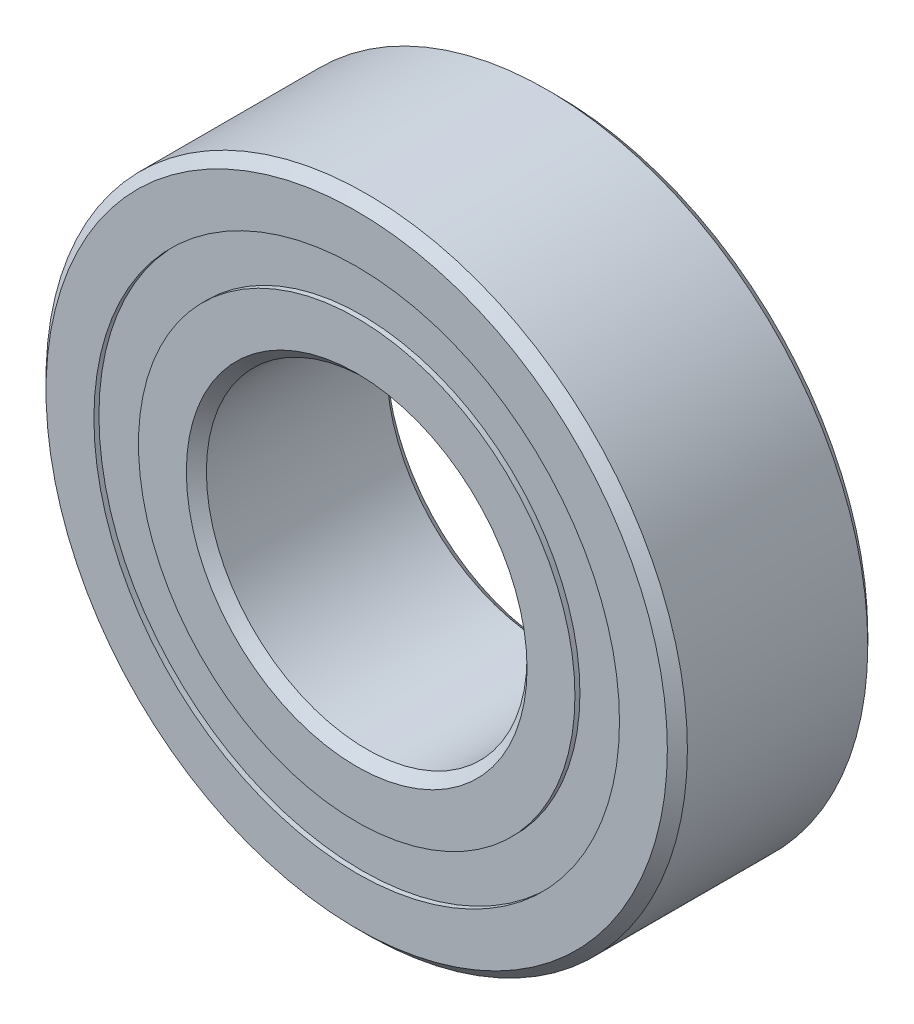
ISO-10303-21;
HEADER;
FILE_DESCRIPTION(('STEP AP214'),'2;1');
FILE_NAME('part.step','',(''),(''),'','','');
FILE_SCHEMA(('AUTOMOTIVE_DESIGN { 1 0 10303 214 1 1 1 1 }'));
ENDSEC;
DATA;
#1=APPLICATION_CONTEXT('core data for automotive mechanical design processes');
#2=APPLICATION_PROTOCOL_DEFINITION('international standard','automotive_design',2000,#1);
#3=PRODUCT_CONTEXT('',#1,'mechanical');
#4=PRODUCT('Part','Part','',(#3));
#5=PRODUCT_RELATED_PRODUCT_CATEGORY('part','',(#4));
#6=PRODUCT_DEFINITION_FORMATION('','',#4);
#7=PRODUCT_DEFINITION_CONTEXT('part definition',#1,'design');
#8=PRODUCT_DEFINITION('design','',#6,#7);
#9=PRODUCT_DEFINITION_SHAPE('','',#8);
#10=(LENGTH_UNIT() NAMED_UNIT(*) SI_UNIT(.MILLI.,.METRE.));
#11=(NAMED_UNIT(*) PLANE_ANGLE_UNIT() SI_UNIT($,.RADIAN.));
#12=(NAMED_UNIT(*) SI_UNIT($,.STERADIAN.) SOLID_ANGLE_UNIT());
#13=UNCERTAINTY_MEASURE_WITH_UNIT(LENGTH_MEASURE(1.E-05),#10,'distance_accuracy_value','');
#14=(GEOMETRIC_REPRESENTATION_CONTEXT(3) GLOBAL_UNCERTAINTY_ASSIGNED_CONTEXT((#13)) GLOBAL_UNIT_ASSIGNED_CONTEXT((#10,
#11,#12)) REPRESENTATION_CONTEXT('',''));
#15=CARTESIAN_POINT('',(0.,0.,0.));
#16=DIRECTION('',(0.,0.,1.));
#17=DIRECTION('',(1.,0.,0.));
#18=AXIS2_PLACEMENT_3D('',#15,#16,#17);
#19=CARTESIAN_POINT('',(0.,6.55555555555555,-1.24225998749989));
#20=DIRECTION('',(0.,0.,-1.));
#21=DIRECTION('',(-1.,0.,0.));
#22=AXIS2_PLACEMENT_3D('',#19,#20,#21);
#23=PLANE('',#22);
#24=CARTESIAN_POINT('',(0.,0.,-1.24225998749989));
#25=DIRECTION('',(0.,0.,1.));
#26=DIRECTION('',(1.,0.,0.));
#27=AXIS2_PLACEMENT_3D('',#24,#25,#26);
#28=CIRCLE('',#27,5.44444444444445);
#29=CARTESIAN_POINT('',(5.44444444444445,0.,-1.24225998749989));
#30=VERTEX_POINT('',#29);
#31=EDGE_CURVE('E11',#30,#30,#28,.T.);
#32=ORIENTED_EDGE('',*,*,#31,.F.);
#33=EDGE_LOOP('',(#32));
#34=FACE_BOUND('',#33,.T.);
#35=CARTESIAN_POINT('',(0.,0.,-1.24225998749988));
#36=DIRECTION('',(0.,0.,1.));
#37=DIRECTION('',(1.,0.,0.));
#38=AXIS2_PLACEMENT_3D('',#35,#36,#37);
#39=CIRCLE('',#38,6.55555555555555);
#40=CARTESIAN_POINT('',(6.55555555555555,0.,-1.24225998749988));
#41=VERTEX_POINT('',#40);
#42=EDGE_CURVE('E60',#41,#41,#39,.T.);
#43=ORIENTED_EDGE('',*,*,#42,.T.);
#44=EDGE_LOOP('',(#43));
#45=FACE_BOUND('',#44,.T.);
#46=ADVANCED_FACE('F46',(#34,#45),#23,.F.);
#47=CARTESIAN_POINT('',(0.,0.,2.5));
#48=DIRECTION('',(0.,0.,1.));
#49=DIRECTION('',(1.,0.,0.));
#50=AXIS2_PLACEMENT_3D('',#47,#48,#49);
#51=CYLINDRICAL_SURFACE('',#50,5.44444444444445);
#52=CARTESIAN_POINT('',(0.,0.,-2.375));
#53=DIRECTION('',(0.,0.,1.));
#54=DIRECTION('',(1.,0.,0.));
#55=AXIS2_PLACEMENT_3D('',#52,#53,#54);
#56=CIRCLE('',#55,5.44444444444445);
#57=CARTESIAN_POINT('',(5.44444444444445,0.,-2.375));
#58=VERTEX_POINT('',#57);
#59=EDGE_CURVE('E52',#58,#58,#56,.T.);
#60=ORIENTED_EDGE('',*,*,#59,.F.);
#61=EDGE_LOOP('',(#60));
#62=FACE_BOUND('',#61,.T.);
#63=ORIENTED_EDGE('',*,*,#31,.T.);
#64=EDGE_LOOP('',(#63));
#65=FACE_BOUND('',#64,.T.);
#66=ADVANCED_FACE('F75',(#62,#65),#51,.F.);
#67=CARTESIAN_POINT('',(0.,6.55555555555555,-2.375));
#68=DIRECTION('',(0.,0.,1.));
#69=DIRECTION('',(1.,0.,0.));
#70=AXIS2_PLACEMENT_3D('',#67,#68,#69);
#71=PLANE('',#70);
#72=CARTESIAN_POINT('',(0.,0.,-2.375));
#73=DIRECTION('',(0.,0.,1.));
#74=DIRECTION('',(1.,0.,0.));
#75=AXIS2_PLACEMENT_3D('',#72,#73,#74);
#76=CIRCLE('',#75,6.55555555555555);
#77=CARTESIAN_POINT('',(6.55555555555555,0.,-2.375));
#78=VERTEX_POINT('',#77);
#79=EDGE_CURVE('E56',#78,#78,#76,.T.);
#80=ORIENTED_EDGE('',*,*,#79,.F.);
#81=EDGE_LOOP('',(#80));
#82=FACE_BOUND('',#81,.T.);
#83=ORIENTED_EDGE('',*,*,#59,.T.);
#84=EDGE_LOOP('',(#83));
#85=FACE_BOUND('',#84,.T.);
#86=ADVANCED_FACE('F70',(#82,#85),#71,.F.);
#87=CARTESIAN_POINT('',(0.,0.,2.5));
#88=DIRECTION('',(0.,0.,1.));
#89=DIRECTION('',(1.,0.,0.));
#90=AXIS2_PLACEMENT_3D('',#87,#88,#89);
#91=CYLINDRICAL_SURFACE('',#90,6.55555555555555);
#92=ORIENTED_EDGE('',*,*,#42,.F.);
#93=EDGE_LOOP('',(#92));
#94=FACE_BOUND('',#93,.T.);
#95=ORIENTED_EDGE('',*,*,#79,.T.);
#96=EDGE_LOOP('',(#95));
#97=FACE_BOUND('',#96,.T.);
#98=ADVANCED_FACE('F67',(#94,#97),#91,.T.);
#99=CLOSED_SHELL('',(#46,#66,#86,#98));
#100=MANIFOLD_SOLID_BREP('B2',#99);
#101=CARTESIAN_POINT('',(0.,6.55555555555555,2.375));
#102=DIRECTION('',(0.,0.,-1.));
#103=DIRECTION('',(-1.,0.,0.));
#104=AXIS2_PLACEMENT_3D('',#101,#102,#103);
#105=PLANE('',#104);
#106=CARTESIAN_POINT('',(0.,0.,2.375));
#107=DIRECTION('',(0.,0.,1.));
#108=DIRECTION('',(1.,0.,0.));
#109=AXIS2_PLACEMENT_3D('',#106,#107,#108);
#110=CIRCLE('',#109,5.44444444444445);
#111=CARTESIAN_POINT('',(5.44444444444445,0.,2.375));
#112=VERTEX_POINT('',#111);
#113=EDGE_CURVE('E45',#112,#112,#110,.T.);
#114=ORIENTED_EDGE('',*,*,#113,.F.);
#115=EDGE_LOOP('',(#114));
#116=FACE_BOUND('',#115,.T.);
#117=CARTESIAN_POINT('',(0.,0.,2.375));
#118=DIRECTION('',(0.,0.,1.));
#119=DIRECTION('',(1.,0.,0.));
#120=AXIS2_PLACEMENT_3D('',#117,#118,#119);
#121=CIRCLE('',#120,6.55555555555555);
#122=CARTESIAN_POINT('',(6.55555555555555,0.,2.375));
#123=VERTEX_POINT('',#122);
#124=EDGE_CURVE('E128',#123,#123,#121,.T.);
#125=ORIENTED_EDGE('',*,*,#124,.T.);
#126=EDGE_LOOP('',(#125));
#127=FACE_BOUND('',#126,.T.);
#128=ADVANCED_FACE('F114',(#116,#127),#105,.F.);
#129=CARTESIAN_POINT('',(0.,0.,2.5));
#130=DIRECTION('',(0.,0.,1.));
#131=DIRECTION('',(1.,0.,0.));
#132=AXIS2_PLACEMENT_3D('',#129,#130,#131);
#133=CYLINDRICAL_SURFACE('',#132,5.44444444444445);
#134=CARTESIAN_POINT('',(0.,0.,1.24225998749988));
#135=DIRECTION('',(0.,0.,1.));
#136=DIRECTION('',(1.,0.,0.));
#137=AXIS2_PLACEMENT_3D('',#134,#135,#136);
#138=CIRCLE('',#137,5.44444444444445);
#139=CARTESIAN_POINT('',(5.44444444444445,0.,1.24225998749988));
#140=VERTEX_POINT('',#139);
#141=EDGE_CURVE('E120',#140,#140,#138,.T.);
#142=ORIENTED_EDGE('',*,*,#141,.F.);
#143=EDGE_LOOP('',(#142));
#144=FACE_BOUND('',#143,.T.);
#145=ORIENTED_EDGE('',*,*,#113,.T.);
#146=EDGE_LOOP('',(#145));
#147=FACE_BOUND('',#146,.T.);
#148=ADVANCED_FACE('F143',(#144,#147),#133,.F.);
#149=CARTESIAN_POINT('',(0.,6.55555555555555,1.24225998749988));
#150=DIRECTION('',(0.,0.,1.));
#151=DIRECTION('',(1.,0.,0.));
#152=AXIS2_PLACEMENT_3D('',#149,#150,#151);
#153=PLANE('',#152);
#154=CARTESIAN_POINT('',(0.,0.,1.24225998749988));
#155=DIRECTION('',(0.,0.,1.));
#156=DIRECTION('',(1.,0.,0.));
#157=AXIS2_PLACEMENT_3D('',#154,#155,#156);
#158=CIRCLE('',#157,6.55555555555555);
#159=CARTESIAN_POINT('',(6.55555555555555,0.,1.24225998749988));
#160=VERTEX_POINT('',#159);
#161=EDGE_CURVE('E124',#160,#160,#158,.T.);
#162=ORIENTED_EDGE('',*,*,#161,.F.);
#163=EDGE_LOOP('',(#162));
#164=FACE_BOUND('',#163,.T.);
#165=ORIENTED_EDGE('',*,*,#141,.T.);
#166=EDGE_LOOP('',(#165));
#167=FACE_BOUND('',#166,.T.);
#168=ADVANCED_FACE('F138',(#164,#167),#153,.F.);
#169=CARTESIAN_POINT('',(0.,0.,2.5));
#170=DIRECTION('',(0.,0.,1.));
#171=DIRECTION('',(1.,0.,0.));
#172=AXIS2_PLACEMENT_3D('',#169,#170,#171);
#173=CYLINDRICAL_SURFACE('',#172,6.55555555555555);
#174=ORIENTED_EDGE('',*,*,#124,.F.);
#175=EDGE_LOOP('',(#174));
#176=FACE_BOUND('',#175,.T.);
#177=ORIENTED_EDGE('',*,*,#161,.T.);
#178=EDGE_LOOP('',(#177));
#179=FACE_BOUND('',#178,.T.);
#180=ADVANCED_FACE('F135',(#176,#179),#173,.T.);
#181=CLOSED_SHELL('',(#128,#148,#168,#180));
#182=MANIFOLD_SOLID_BREP('B6',#181);
#183=CARTESIAN_POINT('',(-2.60330243470528,5.40581320741455,0.));
#184=DIRECTION('',(0.,0.,1.));
#185=DIRECTION('',(-0.433883739117546,0.900968867902425,0.));
#186=AXIS2_PLACEMENT_3D('',#183,#184,#185);
#187=SPHERICAL_SURFACE('',#186,1.24225998749988);
#188=CARTESIAN_POINT('',(-2.60330243470528,5.40581320741455,1.24225998749987));
#189=VERTEX_POINT('',#188);
#190=VERTEX_LOOP('',#189);
#191=FACE_BOUND('',#190,.T.);
#192=ADVANCED_FACE('F182',(#191),#187,.T.);
#193=CLOSED_SHELL('',(#192));
#194=MANIFOLD_SOLID_BREP('B40',#193);
#195=CARTESIAN_POINT('',(-4.69098889480813,3.74093881115246,0.));
#196=DIRECTION('',(0.,0.,1.));
#197=DIRECTION('',(-0.781831482468022,0.623489801858743,0.));
#198=AXIS2_PLACEMENT_3D('',#195,#196,#197);
#199=SPHERICAL_SURFACE('',#198,1.24225998749988);
#200=CARTESIAN_POINT('',(-4.69098889480813,3.74093881115246,1.24225998749987));
#201=VERTEX_POINT('',#200);
#202=VERTEX_LOOP('',#201);
#203=FACE_BOUND('',#202,.T.);
#204=ADVANCED_FACE('F216',(#203),#199,.T.);
#205=CLOSED_SHELL('',(#204));
#206=MANIFOLD_SOLID_BREP('B110',#205);
#207=CARTESIAN_POINT('',(-5.84956747309093,1.33512560373795,0.));
#208=DIRECTION('',(0.,0.,1.));
#209=DIRECTION('',(-0.974927912181821,0.222520933956325,0.));
#210=AXIS2_PLACEMENT_3D('',#207,#208,#209);
#211=SPHERICAL_SURFACE('',#210,1.24225998749988);
#212=CARTESIAN_POINT('',(-5.84956747309093,1.33512560373795,1.24225998749987));
#213=VERTEX_POINT('',#212);
#214=VERTEX_LOOP('',#213);
#215=FACE_BOUND('',#214,.T.);
#216=ADVANCED_FACE('F250',(#215),#211,.T.);
#217=CLOSED_SHELL('',(#216));
#218=MANIFOLD_SOLID_BREP('B178',#217);
#219=CARTESIAN_POINT('',(-5.84956747309096,-1.33512560373783,0.));
#220=DIRECTION('',(0.,0.,1.));
#221=DIRECTION('',(-0.974927912181826,-0.222520933956305,0.));
#222=AXIS2_PLACEMENT_3D('',#219,#220,#221);
#223=SPHERICAL_SURFACE('',#222,1.24225998749988);
#224=CARTESIAN_POINT('',(-5.84956747309096,-1.33512560373783,1.24225998749987));
#225=VERTEX_POINT('',#224);
#226=VERTEX_LOOP('',#225);
#227=FACE_BOUND('',#226,.T.);
#228=ADVANCED_FACE('F284',(#227),#223,.T.);
#229=CLOSED_SHELL('',(#228));
#230=MANIFOLD_SOLID_BREP('B212',#229);
#231=CARTESIAN_POINT('',(-4.69098889480821,-3.74093881115236,0.));
#232=DIRECTION('',(0.,0.,1.));
#233=DIRECTION('',(-0.781831482468035,-0.623489801858727,0.));
#234=AXIS2_PLACEMENT_3D('',#231,#232,#233);
#235=SPHERICAL_SURFACE('',#234,1.24225998749988);
#236=CARTESIAN_POINT('',(-4.69098889480821,-3.74093881115236,1.24225998749987));
#237=VERTEX_POINT('',#236);
#238=VERTEX_LOOP('',#237);
#239=FACE_BOUND('',#238,.T.);
#240=ADVANCED_FACE('F318',(#239),#235,.T.);
#241=CLOSED_SHELL('',(#240));
#242=MANIFOLD_SOLID_BREP('B246',#241);
#243=CARTESIAN_POINT('',(-2.60330243470539,-5.4058132074145,0.));
#244=DIRECTION('',(0.,0.,1.));
#245=DIRECTION('',(-0.433883739117565,-0.900968867902416,0.));
#246=AXIS2_PLACEMENT_3D('',#243,#244,#245);
#247=SPHERICAL_SURFACE('',#246,1.24225998749988);
#248=CARTESIAN_POINT('',(-2.60330243470539,-5.4058132074145,1.24225998749987));
#249=VERTEX_POINT('',#248);
#250=VERTEX_LOOP('',#249);
#251=FACE_BOUND('',#250,.T.);
#252=ADVANCED_FACE('F352',(#251),#247,.T.);
#253=CLOSED_SHELL('',(#252));
#254=MANIFOLD_SOLID_BREP('B280',#253);
#255=CARTESIAN_POINT('',(0.,-6.,0.));
#256=DIRECTION('',(0.,0.,1.));
#257=DIRECTION('',(0.,-1.,0.));
#258=AXIS2_PLACEMENT_3D('',#255,#256,#257);
#259=SPHERICAL_SURFACE('',#258,1.24225998749988);
#260=CARTESIAN_POINT('',(0.,-6.,1.24225998749987));
#261=VERTEX_POINT('',#260);
#262=VERTEX_LOOP('',#261);
#263=FACE_BOUND('',#262,.T.);
#264=ADVANCED_FACE('F386',(#263),#259,.T.);
#265=CLOSED_SHELL('',(#264));
#266=MANIFOLD_SOLID_BREP('B314',#265);
#267=CARTESIAN_POINT('',(2.60330243470532,-5.40581320741453,0.));
#268=DIRECTION('',(0.,0.,1.));
#269=DIRECTION('',(0.433883739117553,-0.900968867902422,0.));
#270=AXIS2_PLACEMENT_3D('',#267,#268,#269);
#271=SPHERICAL_SURFACE('',#270,1.24225998749988);
#272=CARTESIAN_POINT('',(2.60330243470532,-5.40581320741453,1.24225998749987));
#273=VERTEX_POINT('',#272);
#274=VERTEX_LOOP('',#273);
#275=FACE_BOUND('',#274,.T.);
#276=ADVANCED_FACE('F420',(#275),#271,.T.);
#277=CLOSED_SHELL('',(#276));
#278=MANIFOLD_SOLID_BREP('B348',#277);
#279=CARTESIAN_POINT('',(4.69098889480816,-3.74093881115242,0.));
#280=DIRECTION('',(0.,0.,1.));
#281=DIRECTION('',(0.781831482468027,-0.623489801858737,0.));
#282=AXIS2_PLACEMENT_3D('',#279,#280,#281);
#283=SPHERICAL_SURFACE('',#282,1.24225998749988);
#284=CARTESIAN_POINT('',(4.69098889480816,-3.74093881115242,1.24225998749987));
#285=VERTEX_POINT('',#284);
#286=VERTEX_LOOP('',#285);
#287=FACE_BOUND('',#286,.T.);
#288=ADVANCED_FACE('F454',(#287),#283,.T.);
#289=CLOSED_SHELL('',(#288));
#290=MANIFOLD_SOLID_BREP('B382',#289);
#291=CARTESIAN_POINT('',(5.84956747309094,-1.33512560373791,0.));
#292=DIRECTION('',(0.,0.,1.));
#293=DIRECTION('',(0.974927912181823,-0.222520933956318,0.));
#294=AXIS2_PLACEMENT_3D('',#291,#292,#293);
#295=SPHERICAL_SURFACE('',#294,1.24225998749988);
#296=CARTESIAN_POINT('',(5.84956747309094,-1.33512560373791,1.24225998749987));
#297=VERTEX_POINT('',#296);
#298=VERTEX_LOOP('',#297);
#299=FACE_BOUND('',#298,.T.);
#300=ADVANCED_FACE('F488',(#299),#295,.T.);
#301=CLOSED_SHELL('',(#300));
#302=MANIFOLD_SOLID_BREP('B416',#301);
#303=CARTESIAN_POINT('',(5.84956747309095,1.33512560373787,0.));
#304=DIRECTION('',(0.,0.,1.));
#305=DIRECTION('',(0.974927912181824,0.222520933956311,0.));
#306=AXIS2_PLACEMENT_3D('',#303,#304,#305);
#307=SPHERICAL_SURFACE('',#306,1.24225998749988);
#308=CARTESIAN_POINT('',(5.84956747309095,1.33512560373787,1.24225998749987));
#309=VERTEX_POINT('',#308);
#310=VERTEX_LOOP('',#309);
#311=FACE_BOUND('',#310,.T.);
#312=ADVANCED_FACE('F522',(#311),#307,.T.);
#313=CLOSED_SHELL('',(#312));
#314=MANIFOLD_SOLID_BREP('B450',#313);
#315=CARTESIAN_POINT('',(4.69098889480819,3.74093881115239,0.));
#316=DIRECTION('',(0.,0.,1.));
#317=DIRECTION('',(0.781831482468031,0.623489801858732,0.));
#318=AXIS2_PLACEMENT_3D('',#315,#316,#317);
#319=SPHERICAL_SURFACE('',#318,1.24225998749988);
#320=CARTESIAN_POINT('',(4.69098889480819,3.74093881115239,1.24225998749987));
#321=VERTEX_POINT('',#320);
#322=VERTEX_LOOP('',#321);
#323=FACE_BOUND('',#322,.T.);
#324=ADVANCED_FACE('F556',(#323),#319,.T.);
#325=CLOSED_SHELL('',(#324));
#326=MANIFOLD_SOLID_BREP('B484',#325);
#327=CARTESIAN_POINT('',(2.60330243470535,5.40581320741451,0.));
#328=DIRECTION('',(0.,0.,1.));
#329=DIRECTION('',(0.433883739117559,0.900968867902419,0.));
#330=AXIS2_PLACEMENT_3D('',#327,#328,#329);
#331=SPHERICAL_SURFACE('',#330,1.24225998749988);
#332=CARTESIAN_POINT('',(2.60330243470535,5.40581320741451,1.24225998749987));
#333=VERTEX_POINT('',#332);
#334=VERTEX_LOOP('',#333);
#335=FACE_BOUND('',#334,.T.);
#336=ADVANCED_FACE('F590',(#335),#331,.T.);
#337=CLOSED_SHELL('',(#336));
#338=MANIFOLD_SOLID_BREP('B518',#337);
#339=CARTESIAN_POINT('',(0.,6.,0.));
#340=DIRECTION('',(0.,0.,1.));
#341=DIRECTION('',(0.,1.,0.));
#342=AXIS2_PLACEMENT_3D('',#339,#340,#341);
#343=SPHERICAL_SURFACE('',#342,1.24225998749988);
#344=CARTESIAN_POINT('',(0.,6.,1.24225998749987));
#345=VERTEX_POINT('',#344);
#346=VERTEX_LOOP('',#345);
#347=FACE_BOUND('',#346,.T.);
#348=ADVANCED_FACE('F626',(#347),#343,.T.);
#349=CLOSED_SHELL('',(#348));
#350=MANIFOLD_SOLID_BREP('B552',#349);
#351=CARTESIAN_POINT('',(0.,5.44444444444445,2.5));
#352=DIRECTION('',(0.,0.,-1.));
#353=DIRECTION('',(-1.,0.,0.));
#354=AXIS2_PLACEMENT_3D('',#351,#352,#353);
#355=PLANE('',#354);
#356=CARTESIAN_POINT('',(0.,0.,2.5));
#357=DIRECTION('',(0.,0.,1.));
#358=DIRECTION('',(1.,0.,0.));
#359=AXIS2_PLACEMENT_3D('',#356,#357,#358);
#360=CIRCLE('',#359,4.25);
#361=CARTESIAN_POINT('',(4.25,0.,2.5));
#362=VERTEX_POINT('',#361);
#363=EDGE_CURVE('E625',#362,#362,#360,.T.);
#364=ORIENTED_EDGE('',*,*,#363,.F.);
#365=EDGE_LOOP('',(#364));
#366=FACE_BOUND('',#365,.T.);
#367=CARTESIAN_POINT('',(0.,0.,2.5));
#368=DIRECTION('',(0.,0.,1.));
#369=DIRECTION('',(1.,0.,0.));
#370=AXIS2_PLACEMENT_3D('',#367,#368,#369);
#371=CIRCLE('',#370,5.44444444444445);
#372=CARTESIAN_POINT('',(5.44444444444445,0.,2.5));
#373=VERTEX_POINT('',#372);
#374=EDGE_CURVE('E674',#373,#373,#371,.T.);
#375=ORIENTED_EDGE('',*,*,#374,.T.);
#376=EDGE_LOOP('',(#375));
#377=FACE_BOUND('',#376,.T.);
#378=ADVANCED_FACE('F646',(#366,#377),#355,.F.);
#379=CARTESIAN_POINT('',(0.,0.,2.5));
#380=DIRECTION('',(0.,0.,1.));
#381=DIRECTION('',(1.,0.,0.));
#382=AXIS2_PLACEMENT_3D('',#379,#380,#381);
#383=CONICAL_SURFACE('',#382,4.25,0.785398163397445);
#384=CARTESIAN_POINT('',(0.,0.,2.25));
#385=DIRECTION('',(0.,0.,1.));
#386=DIRECTION('',(1.,0.,0.));
#387=AXIS2_PLACEMENT_3D('',#384,#385,#386);
#388=CIRCLE('',#387,4.);
#389=CARTESIAN_POINT('',(4.,0.,2.25));
#390=VERTEX_POINT('',#389);
#391=EDGE_CURVE('E652',#390,#390,#388,.T.);
#392=ORIENTED_EDGE('',*,*,#391,.F.);
#393=EDGE_LOOP('',(#392));
#394=FACE_BOUND('',#393,.T.);
#395=ORIENTED_EDGE('',*,*,#363,.T.);
#396=EDGE_LOOP('',(#395));
#397=FACE_BOUND('',#396,.T.);
#398=ADVANCED_FACE('F711',(#394,#397),#383,.F.);
#399=CARTESIAN_POINT('',(0.,0.,2.5));
#400=DIRECTION('',(0.,0.,1.));
#401=DIRECTION('',(1.,0.,0.));
#402=AXIS2_PLACEMENT_3D('',#399,#400,#401);
#403=CYLINDRICAL_SURFACE('',#402,4.);
#404=CARTESIAN_POINT('',(0.,0.,-2.25));
#405=DIRECTION('',(0.,0.,1.));
#406=DIRECTION('',(1.,0.,0.));
#407=AXIS2_PLACEMENT_3D('',#404,#405,#406);
#408=CIRCLE('',#407,4.);
#409=CARTESIAN_POINT('',(4.,0.,-2.25));
#410=VERTEX_POINT('',#409);
#411=EDGE_CURVE('E656',#410,#410,#408,.T.);
#412=ORIENTED_EDGE('',*,*,#411,.F.);
#413=EDGE_LOOP('',(#412));
#414=FACE_BOUND('',#413,.T.);
#415=ORIENTED_EDGE('',*,*,#391,.T.);
#416=EDGE_LOOP('',(#415));
#417=FACE_BOUND('',#416,.T.);
#418=ADVANCED_FACE('F706',(#414,#417),#403,.F.);
#419=CARTESIAN_POINT('',(0.,0.,-2.25));
#420=DIRECTION('',(0.,0.,-1.));
#421=DIRECTION('',(-1.,0.,0.));
#422=AXIS2_PLACEMENT_3D('',#419,#420,#421);
#423=CONICAL_SURFACE('',#422,4.,0.785398163397448);
#424=CARTESIAN_POINT('',(0.,0.,-2.5));
#425=DIRECTION('',(0.,0.,1.));
#426=DIRECTION('',(1.,0.,0.));
#427=AXIS2_PLACEMENT_3D('',#424,#425,#426);
#428=CIRCLE('',#427,4.25);
#429=CARTESIAN_POINT('',(4.25,0.,-2.5));
#430=VERTEX_POINT('',#429);
#431=EDGE_CURVE('E660',#430,#430,#428,.T.);
#432=ORIENTED_EDGE('',*,*,#431,.F.);
#433=EDGE_LOOP('',(#432));
#434=FACE_BOUND('',#433,.T.);
#435=ORIENTED_EDGE('',*,*,#411,.T.);
#436=EDGE_LOOP('',(#435));
#437=FACE_BOUND('',#436,.T.);
#438=ADVANCED_FACE('F700',(#434,#437),#423,.F.);
#439=CARTESIAN_POINT('',(0.,5.44444444444445,-2.5));
#440=DIRECTION('',(0.,0.,1.));
#441=DIRECTION('',(1.,0.,0.));
#442=AXIS2_PLACEMENT_3D('',#439,#440,#441);
#443=PLANE('',#442);
#444=CARTESIAN_POINT('',(0.,0.,-2.5));
#445=DIRECTION('',(0.,0.,1.));
#446=DIRECTION('',(1.,0.,0.));
#447=AXIS2_PLACEMENT_3D('',#444,#445,#446);
#448=CIRCLE('',#447,5.44444444444445);
#449=CARTESIAN_POINT('',(5.44444444444445,0.,-2.5));
#450=VERTEX_POINT('',#449);
#451=EDGE_CURVE('E665',#450,#450,#448,.T.);
#452=ORIENTED_EDGE('',*,*,#451,.F.);
#453=EDGE_LOOP('',(#452));
#454=FACE_BOUND('',#453,.T.);
#455=ORIENTED_EDGE('',*,*,#431,.T.);
#456=EDGE_LOOP('',(#455));
#457=FACE_BOUND('',#456,.T.);
#458=ADVANCED_FACE('F694',(#454,#457),#443,.F.);
#459=CARTESIAN_POINT('',(0.,0.,2.5));
#460=DIRECTION('',(0.,0.,1.));
#461=DIRECTION('',(1.,0.,0.));
#462=AXIS2_PLACEMENT_3D('',#459,#460,#461);
#463=CYLINDRICAL_SURFACE('',#462,5.44444444444445);
#464=CARTESIAN_POINT('',(0.,0.,-1.11111111111111));
#465=DIRECTION('',(0.,0.,1.));
#466=DIRECTION('',(1.,0.,0.));
#467=AXIS2_PLACEMENT_3D('',#464,#465,#466);
#468=CIRCLE('',#467,5.44444444444445);
#469=CARTESIAN_POINT('',(5.44444444444445,0.,-1.11111111111111));
#470=VERTEX_POINT('',#469);
#471=EDGE_CURVE('E668',#470,#470,#468,.T.);
#472=ORIENTED_EDGE('',*,*,#471,.F.);
#473=EDGE_LOOP('',(#472));
#474=FACE_BOUND('',#473,.T.);
#475=ORIENTED_EDGE('',*,*,#451,.T.);
#476=EDGE_LOOP('',(#475));
#477=FACE_BOUND('',#476,.T.);
#478=ADVANCED_FACE('F688',(#474,#477),#463,.T.);
#479=CARTESIAN_POINT('',(0.,0.,0.));
#480=DIRECTION('',(0.,0.,1.));
#481=DIRECTION('',(1.,0.,0.));
#482=AXIS2_PLACEMENT_3D('',#479,#480,#481);
#483=TOROIDAL_SURFACE('',#482,6.,1.24225998749988);
#484=CARTESIAN_POINT('',(0.,0.,1.11111111111111));
#485=DIRECTION('',(0.,0.,1.));
#486=DIRECTION('',(1.,0.,0.));
#487=AXIS2_PLACEMENT_3D('',#484,#485,#486);
#488=CIRCLE('',#487,5.44444444444445);
#489=CARTESIAN_POINT('',(5.44444444444445,0.,1.11111111111111));
#490=VERTEX_POINT('',#489);
#491=EDGE_CURVE('E671',#490,#490,#488,.T.);
#492=ORIENTED_EDGE('',*,*,#491,.F.);
#493=EDGE_LOOP('',(#492));
#494=FACE_BOUND('',#493,.T.);
#495=ORIENTED_EDGE('',*,*,#471,.T.);
#496=EDGE_LOOP('',(#495));
#497=FACE_BOUND('',#496,.T.);
#498=ADVANCED_FACE('F682',(#494,#497),#483,.F.);
#499=CARTESIAN_POINT('',(0.,0.,2.5));
#500=DIRECTION('',(0.,0.,1.));
#501=DIRECTION('',(1.,0.,0.));
#502=AXIS2_PLACEMENT_3D('',#499,#500,#501);
#503=CYLINDRICAL_SURFACE('',#502,5.44444444444445);
#504=ORIENTED_EDGE('',*,*,#374,.F.);
#505=EDGE_LOOP('',(#504));
#506=FACE_BOUND('',#505,.T.);
#507=ORIENTED_EDGE('',*,*,#491,.T.);
#508=EDGE_LOOP('',(#507));
#509=FACE_BOUND('',#508,.T.);
#510=ADVANCED_FACE('F679',(#506,#509),#503,.T.);
#511=CLOSED_SHELL('',(#378,#398,#418,#438,#458,#478,#498,#510));
#512=MANIFOLD_SOLID_BREP('B586',#511);
#513=CARTESIAN_POINT('',(0.,0.,2.25));
#514=DIRECTION('',(0.,0.,-1.));
#515=DIRECTION('',(-1.,0.,0.));
#516=AXIS2_PLACEMENT_3D('',#513,#514,#515);
#517=CONICAL_SURFACE('',#516,8.,0.785398163397448);
#518=CARTESIAN_POINT('',(0.,0.,2.5));
#519=DIRECTION('',(0.,0.,1.));
#520=DIRECTION('',(1.,0.,0.));
#521=AXIS2_PLACEMENT_3D('',#518,#519,#520);
#522=CIRCLE('',#521,7.75);
#523=CARTESIAN_POINT('',(7.75,0.,2.5));
#524=VERTEX_POINT('',#523);
#525=EDGE_CURVE('E796',#524,#524,#522,.T.);
#526=ORIENTED_EDGE('',*,*,#525,.F.);
#527=EDGE_LOOP('',(#526));
#528=FACE_BOUND('',#527,.T.);
#529=CARTESIAN_POINT('',(0.,0.,2.25));
#530=DIRECTION('',(0.,0.,1.));
#531=DIRECTION('',(1.,0.,0.));
#532=AXIS2_PLACEMENT_3D('',#529,#530,#531);
#533=CIRCLE('',#532,8.);
#534=CARTESIAN_POINT('',(8.,0.,2.25));
#535=VERTEX_POINT('',#534);
#536=EDGE_CURVE('E645',#535,#535,#533,.T.);
#537=ORIENTED_EDGE('',*,*,#536,.T.);
#538=EDGE_LOOP('',(#537));
#539=FACE_BOUND('',#538,.T.);
#540=ADVANCED_FACE('F768',(#528,#539),#517,.T.);
#541=CARTESIAN_POINT('',(0.,0.,2.5));
#542=DIRECTION('',(0.,0.,1.));
#543=DIRECTION('',(1.,0.,0.));
#544=AXIS2_PLACEMENT_3D('',#541,#542,#543);
#545=CYLINDRICAL_SURFACE('',#544,8.);
#546=ORIENTED_EDGE('',*,*,#536,.F.);
#547=EDGE_LOOP('',(#546));
#548=FACE_BOUND('',#547,.T.);
#549=CARTESIAN_POINT('',(0.,0.,-2.25000000000001));
#550=DIRECTION('',(0.,0.,1.));
#551=DIRECTION('',(1.,0.,0.));
#552=AXIS2_PLACEMENT_3D('',#549,#550,#551);
#553=CIRCLE('',#552,8.);
#554=CARTESIAN_POINT('',(8.,0.,-2.25000000000001));
#555=VERTEX_POINT('',#554);
#556=EDGE_CURVE('E774',#555,#555,#553,.T.);
#557=ORIENTED_EDGE('',*,*,#556,.T.);
#558=EDGE_LOOP('',(#557));
#559=FACE_BOUND('',#558,.T.);
#560=ADVANCED_FACE('F803',(#548,#559),#545,.T.);
#561=CARTESIAN_POINT('',(0.,0.,-2.50000000000001));
#562=DIRECTION('',(0.,0.,1.));
#563=DIRECTION('',(1.,0.,0.));
#564=AXIS2_PLACEMENT_3D('',#561,#562,#563);
#565=CONICAL_SURFACE('',#564,7.75,0.785398163397448);
#566=ORIENTED_EDGE('',*,*,#556,.F.);
#567=EDGE_LOOP('',(#566));
#568=FACE_BOUND('',#567,.T.);
#569=CARTESIAN_POINT('',(0.,0.,-2.50000000000001));
#570=DIRECTION('',(0.,0.,1.));
#571=DIRECTION('',(1.,0.,0.));
#572=AXIS2_PLACEMENT_3D('',#569,#570,#571);
#573=CIRCLE('',#572,7.75);
#574=CARTESIAN_POINT('',(7.75,0.,-2.50000000000001));
#575=VERTEX_POINT('',#574);
#576=EDGE_CURVE('E778',#575,#575,#573,.T.);
#577=ORIENTED_EDGE('',*,*,#576,.T.);
#578=EDGE_LOOP('',(#577));
#579=FACE_BOUND('',#578,.T.);
#580=ADVANCED_FACE('F807',(#568,#579),#565,.T.);
#581=CARTESIAN_POINT('',(0.,7.75,-2.50000000000001));
#582=DIRECTION('',(0.,0.,1.));
#583=DIRECTION('',(1.,0.,0.));
#584=AXIS2_PLACEMENT_3D('',#581,#582,#583);
#585=PLANE('',#584);
#586=ORIENTED_EDGE('',*,*,#576,.F.);
#587=EDGE_LOOP('',(#586));
#588=FACE_BOUND('',#587,.T.);
#589=CARTESIAN_POINT('',(0.,0.,-2.50000000000001));
#590=DIRECTION('',(0.,0.,1.));
#591=DIRECTION('',(1.,0.,0.));
#592=AXIS2_PLACEMENT_3D('',#589,#590,#591);
#593=CIRCLE('',#592,6.55555555555555);
#594=CARTESIAN_POINT('',(6.55555555555555,0.,-2.50000000000001));
#595=VERTEX_POINT('',#594);
#596=EDGE_CURVE('E782',#595,#595,#593,.T.);
#597=ORIENTED_EDGE('',*,*,#596,.T.);
#598=EDGE_LOOP('',(#597));
#599=FACE_BOUND('',#598,.T.);
#600=ADVANCED_FACE('F812',(#588,#599),#585,.F.);
#601=CARTESIAN_POINT('',(0.,0.,2.5));
#602=DIRECTION('',(0.,0.,1.));
#603=DIRECTION('',(1.,0.,0.));
#604=AXIS2_PLACEMENT_3D('',#601,#602,#603);
#605=CYLINDRICAL_SURFACE('',#604,6.55555555555555);
#606=ORIENTED_EDGE('',*,*,#596,.F.);
#607=EDGE_LOOP('',(#606));
#608=FACE_BOUND('',#607,.T.);
#609=CARTESIAN_POINT('',(0.,0.,-1.11111111111111));
#610=DIRECTION('',(0.,0.,1.));
#611=DIRECTION('',(1.,0.,0.));
#612=AXIS2_PLACEMENT_3D('',#609,#610,#611);
#613=CIRCLE('',#612,6.55555555555555);
#614=CARTESIAN_POINT('',(6.55555555555555,0.,-1.11111111111111));
#615=VERTEX_POINT('',#614);
#616=EDGE_CURVE('E787',#615,#615,#613,.T.);
#617=ORIENTED_EDGE('',*,*,#616,.T.);
#618=EDGE_LOOP('',(#617));
#619=FACE_BOUND('',#618,.T.);
#620=ADVANCED_FACE('F818',(#608,#619),#605,.F.);
#621=CARTESIAN_POINT('',(0.,0.,0.));
#622=DIRECTION('',(0.,0.,1.));
#623=DIRECTION('',(1.,0.,0.));
#624=AXIS2_PLACEMENT_3D('',#621,#622,#623);
#625=TOROIDAL_SURFACE('',#624,6.,1.24225998749988);
#626=ORIENTED_EDGE('',*,*,#616,.F.);
#627=EDGE_LOOP('',(#626));
#628=FACE_BOUND('',#627,.T.);
#629=CARTESIAN_POINT('',(0.,0.,1.11111111111111));
#630=DIRECTION('',(0.,0.,1.));
#631=DIRECTION('',(1.,0.,0.));
#632=AXIS2_PLACEMENT_3D('',#629,#630,#631);
#633=CIRCLE('',#632,6.55555555555555);
#634=CARTESIAN_POINT('',(6.55555555555555,0.,1.11111111111111));
#635=VERTEX_POINT('',#634);
#636=EDGE_CURVE('E790',#635,#635,#633,.T.);
#637=ORIENTED_EDGE('',*,*,#636,.T.);
#638=EDGE_LOOP('',(#637));
#639=FACE_BOUND('',#638,.T.);
#640=ADVANCED_FACE('F822',(#628,#639),#625,.F.);
#641=CARTESIAN_POINT('',(0.,0.,2.5));
#642=DIRECTION('',(0.,0.,1.));
#643=DIRECTION('',(1.,0.,0.));
#644=AXIS2_PLACEMENT_3D('',#641,#642,#643);
#645=CYLINDRICAL_SURFACE('',#644,6.55555555555555);
#646=ORIENTED_EDGE('',*,*,#636,.F.);
#647=EDGE_LOOP('',(#646));
#648=FACE_BOUND('',#647,.T.);
#649=CARTESIAN_POINT('',(0.,0.,2.5));
#650=DIRECTION('',(0.,0.,1.));
#651=DIRECTION('',(1.,0.,0.));
#652=AXIS2_PLACEMENT_3D('',#649,#650,#651);
#653=CIRCLE('',#652,6.55555555555555);
#654=CARTESIAN_POINT('',(6.55555555555555,0.,2.5));
#655=VERTEX_POINT('',#654);
#656=EDGE_CURVE('E793',#655,#655,#653,.T.);
#657=ORIENTED_EDGE('',*,*,#656,.T.);
#658=EDGE_LOOP('',(#657));
#659=FACE_BOUND('',#658,.T.);
#660=ADVANCED_FACE('F826',(#648,#659),#645,.F.);
#661=CARTESIAN_POINT('',(0.,7.75,2.5));
#662=DIRECTION('',(0.,0.,-1.));
#663=DIRECTION('',(-1.,0.,0.));
#664=AXIS2_PLACEMENT_3D('',#661,#662,#663);
#665=PLANE('',#664);
#666=ORIENTED_EDGE('',*,*,#656,.F.);
#667=EDGE_LOOP('',(#666));
#668=FACE_BOUND('',#667,.T.);
#669=ORIENTED_EDGE('',*,*,#525,.T.);
#670=EDGE_LOOP('',(#669));
#671=FACE_BOUND('',#670,.T.);
#672=ADVANCED_FACE('F800',(#668,#671),#665,.F.);
#673=CLOSED_SHELL('',(#540,#560,#580,#600,#620,#640,#660,#672));
#674=MANIFOLD_SOLID_BREP('B620',#673);
#675=ADVANCED_BREP_SHAPE_REPRESENTATION('',(#18,#100,#182,#194,#206,#218,#230,#242,#254,#266,
#278,#290,#302,#314,#326,#338,#350,#512,#674),#14);
#676=SHAPE_DEFINITION_REPRESENTATION(#9,#675);
ENDSEC;
END-ISO-10303-21;
